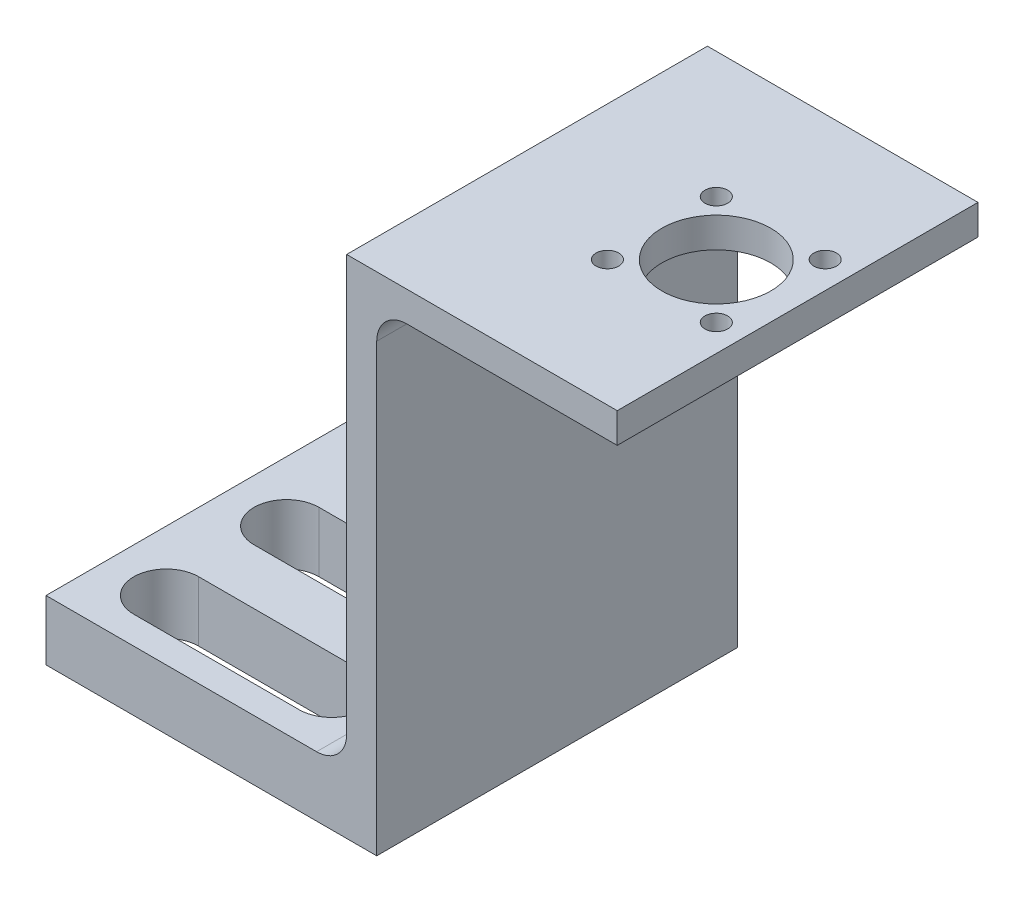
ISO-10303-21;
HEADER;
FILE_DESCRIPTION(('STEP AP214'),'2;1');
FILE_NAME('part.step','',(''),(''),'','','');
FILE_SCHEMA(('AUTOMOTIVE_DESIGN { 1 0 10303 214 1 1 1 1 }'));
ENDSEC;
DATA;
#1=APPLICATION_CONTEXT('core data for automotive mechanical design processes');
#2=APPLICATION_PROTOCOL_DEFINITION('international standard','automotive_design',2000,#1);
#3=PRODUCT_CONTEXT('',#1,'mechanical');
#4=PRODUCT('Part','Part','',(#3));
#5=PRODUCT_RELATED_PRODUCT_CATEGORY('part','',(#4));
#6=PRODUCT_DEFINITION_FORMATION('','',#4);
#7=PRODUCT_DEFINITION_CONTEXT('part definition',#1,'design');
#8=PRODUCT_DEFINITION('design','',#6,#7);
#9=PRODUCT_DEFINITION_SHAPE('','',#8);
#10=(LENGTH_UNIT() NAMED_UNIT(*) SI_UNIT(.MILLI.,.METRE.));
#11=(NAMED_UNIT(*) PLANE_ANGLE_UNIT() SI_UNIT($,.RADIAN.));
#12=(NAMED_UNIT(*) SI_UNIT($,.STERADIAN.) SOLID_ANGLE_UNIT());
#13=UNCERTAINTY_MEASURE_WITH_UNIT(LENGTH_MEASURE(1.E-05),#10,'distance_accuracy_value','');
#14=(GEOMETRIC_REPRESENTATION_CONTEXT(3) GLOBAL_UNCERTAINTY_ASSIGNED_CONTEXT((#13)) GLOBAL_UNIT_ASSIGNED_CONTEXT((#10,
#11,#12)) REPRESENTATION_CONTEXT('',''));
#15=CARTESIAN_POINT('',(0.,0.,0.));
#16=DIRECTION('',(0.,0.,1.));
#17=DIRECTION('',(1.,0.,0.));
#18=AXIS2_PLACEMENT_3D('',#15,#16,#17);
#19=CARTESIAN_POINT('',(-34.925,6.35,19.05));
#20=DIRECTION('',(1.,0.,0.));
#21=DIRECTION('',(0.,1.,0.));
#22=AXIS2_PLACEMENT_3D('',#19,#20,#21);
#23=PLANE('',#22);
#24=DIRECTION('',(0.,-1.,0.));
#25=VECTOR('',#24,1.);
#26=CARTESIAN_POINT('',(-34.925,6.35,-19.05));
#27=LINE('',#26,#25);
#28=CARTESIAN_POINT('',(-34.925,6.35,-19.05));
#29=VERTEX_POINT('',#28);
#30=CARTESIAN_POINT('',(-34.925,0.,-19.05));
#31=VERTEX_POINT('',#30);
#32=EDGE_CURVE('E308',#29,#31,#27,.T.);
#33=ORIENTED_EDGE('',*,*,#32,.T.);
#34=DIRECTION('',(0.,0.,-1.));
#35=VECTOR('',#34,1.);
#36=CARTESIAN_POINT('',(-34.925,0.,19.05));
#37=LINE('',#36,#35);
#38=CARTESIAN_POINT('',(-34.925,0.,19.05));
#39=VERTEX_POINT('',#38);
#40=EDGE_CURVE('E363',#39,#31,#37,.T.);
#41=ORIENTED_EDGE('',*,*,#40,.F.);
#42=DIRECTION('',(0.,-1.,0.));
#43=VECTOR('',#42,1.);
#44=CARTESIAN_POINT('',(-34.925,6.35,19.05));
#45=LINE('',#44,#43);
#46=CARTESIAN_POINT('',(-34.925,6.35,19.05));
#47=VERTEX_POINT('',#46);
#48=EDGE_CURVE('E311',#47,#39,#45,.T.);
#49=ORIENTED_EDGE('',*,*,#48,.F.);
#50=DIRECTION('',(0.,0.,-1.));
#51=VECTOR('',#50,1.);
#52=CARTESIAN_POINT('',(-34.925,6.35,19.05));
#53=LINE('',#52,#51);
#54=EDGE_CURVE('E331',#47,#29,#53,.T.);
#55=ORIENTED_EDGE('',*,*,#54,.T.);
#56=EDGE_LOOP('',(#33,#41,#49,#55));
#57=FACE_BOUND('',#56,.T.);
#58=ADVANCED_FACE('F33',(#57),#23,.F.);
#59=CARTESIAN_POINT('',(-34.925,0.,19.05));
#60=DIRECTION('',(0.,1.,0.));
#61=DIRECTION('',(0.,0.,1.));
#62=AXIS2_PLACEMENT_3D('',#59,#60,#61);
#63=PLANE('',#62);
#64=DIRECTION('',(-1.,0.,0.));
#65=VECTOR('',#64,1.);
#66=CARTESIAN_POINT('',(-28.575,0.,-16.129));
#67=LINE('',#66,#65);
#68=CARTESIAN_POINT('',(-11.1125,0.,-16.129));
#69=VERTEX_POINT('',#68);
#70=CARTESIAN_POINT('',(-28.575,0.,-16.129));
#71=VERTEX_POINT('',#70);
#72=EDGE_CURVE('E209',#69,#71,#67,.T.);
#73=ORIENTED_EDGE('',*,*,#72,.T.);
#74=CARTESIAN_POINT('',(-28.575,0.,-12.7));
#75=DIRECTION('',(0.,1.,0.));
#76=DIRECTION('',(-1.,0.,0.));
#77=AXIS2_PLACEMENT_3D('',#74,#75,#76);
#78=CIRCLE('',#77,3.429);
#79=CARTESIAN_POINT('',(-28.575,0.,-9.271));
#80=VERTEX_POINT('',#79);
#81=EDGE_CURVE('E213',#71,#80,#78,.T.);
#82=ORIENTED_EDGE('',*,*,#81,.T.);
#83=DIRECTION('',(1.,0.,0.));
#84=VECTOR('',#83,1.);
#85=CARTESIAN_POINT('',(-28.575,0.,-9.271));
#86=LINE('',#85,#84);
#87=CARTESIAN_POINT('',(-11.1125,0.,-9.271));
#88=VERTEX_POINT('',#87);
#89=EDGE_CURVE('E190',#80,#88,#86,.T.);
#90=ORIENTED_EDGE('',*,*,#89,.T.);
#91=CARTESIAN_POINT('',(-11.1125,0.,-12.7));
#92=DIRECTION('',(0.,1.,0.));
#93=DIRECTION('',(-1.,0.,0.));
#94=AXIS2_PLACEMENT_3D('',#91,#92,#93);
#95=CIRCLE('',#94,3.429);
#96=EDGE_CURVE('E48',#88,#69,#95,.T.);
#97=ORIENTED_EDGE('',*,*,#96,.T.);
#98=EDGE_LOOP('',(#73,#82,#90,#97));
#99=FACE_BOUND('',#98,.T.);
#100=DIRECTION('',(-1.,0.,0.));
#101=VECTOR('',#100,1.);
#102=CARTESIAN_POINT('',(-28.575,0.,9.271));
#103=LINE('',#102,#101);
#104=CARTESIAN_POINT('',(-11.1125,0.,9.271));
#105=VERTEX_POINT('',#104);
#106=CARTESIAN_POINT('',(-28.575,0.,9.271));
#107=VERTEX_POINT('',#106);
#108=EDGE_CURVE('E240',#105,#107,#103,.T.);
#109=ORIENTED_EDGE('',*,*,#108,.T.);
#110=CARTESIAN_POINT('',(-28.575,0.,12.7));
#111=DIRECTION('',(0.,1.,0.));
#112=DIRECTION('',(-1.,0.,0.));
#113=AXIS2_PLACEMENT_3D('',#110,#111,#112);
#114=CIRCLE('',#113,3.429);
#115=CARTESIAN_POINT('',(-28.575,0.,16.129));
#116=VERTEX_POINT('',#115);
#117=EDGE_CURVE('E245',#107,#116,#114,.T.);
#118=ORIENTED_EDGE('',*,*,#117,.T.);
#119=DIRECTION('',(1.,0.,0.));
#120=VECTOR('',#119,1.);
#121=CARTESIAN_POINT('',(-28.575,0.,16.129));
#122=LINE('',#121,#120);
#123=CARTESIAN_POINT('',(-11.1125,0.,16.129));
#124=VERTEX_POINT('',#123);
#125=EDGE_CURVE('E218',#116,#124,#122,.T.);
#126=ORIENTED_EDGE('',*,*,#125,.T.);
#127=CARTESIAN_POINT('',(-11.1125,0.,12.7));
#128=DIRECTION('',(0.,1.,0.));
#129=DIRECTION('',(-1.,0.,0.));
#130=AXIS2_PLACEMENT_3D('',#127,#128,#129);
#131=CIRCLE('',#130,3.429);
#132=EDGE_CURVE('E232',#124,#105,#131,.T.);
#133=ORIENTED_EDGE('',*,*,#132,.T.);
#134=EDGE_LOOP('',(#109,#118,#126,#133));
#135=FACE_BOUND('',#134,.T.);
#136=DIRECTION('',(-1.,0.,0.));
#137=VECTOR('',#136,1.);
#138=CARTESIAN_POINT('',(-28.575,0.,-3.429));
#139=LINE('',#138,#137);
#140=CARTESIAN_POINT('',(-11.1125,0.,-3.429));
#141=VERTEX_POINT('',#140);
#142=CARTESIAN_POINT('',(-28.575,0.,-3.429));
#143=VERTEX_POINT('',#142);
#144=EDGE_CURVE('E259',#141,#143,#139,.T.);
#145=ORIENTED_EDGE('',*,*,#144,.T.);
#146=CARTESIAN_POINT('',(-28.575,0.,0.));
#147=DIRECTION('',(0.,1.,0.));
#148=DIRECTION('',(-1.,0.,0.));
#149=AXIS2_PLACEMENT_3D('',#146,#147,#148);
#150=CIRCLE('',#149,3.429);
#151=CARTESIAN_POINT('',(-28.575,0.,3.429));
#152=VERTEX_POINT('',#151);
#153=EDGE_CURVE('E249',#143,#152,#150,.T.);
#154=ORIENTED_EDGE('',*,*,#153,.T.);
#155=DIRECTION('',(1.,0.,0.));
#156=VECTOR('',#155,1.);
#157=CARTESIAN_POINT('',(-28.575,0.,3.429));
#158=LINE('',#157,#156);
#159=CARTESIAN_POINT('',(-11.1125,0.,3.429));
#160=VERTEX_POINT('',#159);
#161=EDGE_CURVE('E252',#152,#160,#158,.T.);
#162=ORIENTED_EDGE('',*,*,#161,.T.);
#163=CARTESIAN_POINT('',(-11.1125,0.,0.));
#164=DIRECTION('',(0.,1.,0.));
#165=DIRECTION('',(-1.,0.,0.));
#166=AXIS2_PLACEMENT_3D('',#163,#164,#165);
#167=CIRCLE('',#166,3.429);
#168=EDGE_CURVE('E256',#160,#141,#167,.T.);
#169=ORIENTED_EDGE('',*,*,#168,.T.);
#170=EDGE_LOOP('',(#145,#154,#162,#169));
#171=FACE_BOUND('',#170,.T.);
#172=DIRECTION('',(1.,0.,0.));
#173=VECTOR('',#172,1.);
#174=CARTESIAN_POINT('',(-34.925,0.,-19.05));
#175=LINE('',#174,#173);
#176=CARTESIAN_POINT('',(0.,0.,-19.05));
#177=VERTEX_POINT('',#176);
#178=EDGE_CURVE('E334',#31,#177,#175,.T.);
#179=ORIENTED_EDGE('',*,*,#178,.T.);
#180=DIRECTION('',(0.,0.,-1.));
#181=VECTOR('',#180,1.);
#182=CARTESIAN_POINT('',(0.,0.,19.05));
#183=LINE('',#182,#181);
#184=CARTESIAN_POINT('',(0.,0.,19.05));
#185=VERTEX_POINT('',#184);
#186=EDGE_CURVE('E360',#185,#177,#183,.T.);
#187=ORIENTED_EDGE('',*,*,#186,.F.);
#188=DIRECTION('',(1.,0.,0.));
#189=VECTOR('',#188,1.);
#190=CARTESIAN_POINT('',(-34.925,0.,19.05));
#191=LINE('',#190,#189);
#192=EDGE_CURVE('E314',#39,#185,#191,.T.);
#193=ORIENTED_EDGE('',*,*,#192,.F.);
#194=ORIENTED_EDGE('',*,*,#40,.T.);
#195=EDGE_LOOP('',(#179,#187,#193,#194));
#196=FACE_BOUND('',#195,.T.);
#197=ADVANCED_FACE('F405',(#99,#135,#171,#196),#63,.F.);
#198=CARTESIAN_POINT('',(0.,0.,19.05));
#199=DIRECTION('',(-1.,0.,0.));
#200=DIRECTION('',(0.,0.,1.));
#201=AXIS2_PLACEMENT_3D('',#198,#199,#200);
#202=PLANE('',#201);
#203=DIRECTION('',(0.,1.,0.));
#204=VECTOR('',#203,1.);
#205=CARTESIAN_POINT('',(0.,0.,-19.05));
#206=LINE('',#205,#204);
#207=CARTESIAN_POINT('',(0.,47.0662,-19.05));
#208=VERTEX_POINT('',#207);
#209=EDGE_CURVE('E336',#177,#208,#206,.T.);
#210=ORIENTED_EDGE('',*,*,#209,.T.);
#211=DIRECTION('',(0.,0.,-1.));
#212=VECTOR('',#211,1.);
#213=CARTESIAN_POINT('',(0.,47.0662,19.05));
#214=LINE('',#213,#212);
#215=CARTESIAN_POINT('',(0.,47.0662,19.05));
#216=VERTEX_POINT('',#215);
#217=EDGE_CURVE('E369',#208,#216,#214,.F.);
#218=ORIENTED_EDGE('',*,*,#217,.T.);
#219=DIRECTION('',(0.,1.,0.));
#220=VECTOR('',#219,1.);
#221=CARTESIAN_POINT('',(0.,0.,19.05));
#222=LINE('',#221,#220);
#223=EDGE_CURVE('E317',#185,#216,#222,.T.);
#224=ORIENTED_EDGE('',*,*,#223,.F.);
#225=ORIENTED_EDGE('',*,*,#186,.T.);
#226=EDGE_LOOP('',(#210,#218,#224,#225));
#227=FACE_BOUND('',#226,.T.);
#228=ADVANCED_FACE('F408',(#227),#202,.F.);
#229=CARTESIAN_POINT('',(0.,50.2412,19.05));
#230=DIRECTION('',(0.,1.,0.));
#231=DIRECTION('',(0.,0.,1.));
#232=AXIS2_PLACEMENT_3D('',#229,#230,#231);
#233=PLANE('',#232);
#234=CARTESIAN_POINT('',(22.5625,50.2412,5.75));
#235=DIRECTION('',(0.,-1.,0.));
#236=DIRECTION('',(0.,0.,-1.));
#237=AXIS2_PLACEMENT_3D('',#234,#235,#236);
#238=CIRCLE('',#237,1.2);
#239=CARTESIAN_POINT('',(22.5625,50.2412,4.55));
#240=VERTEX_POINT('',#239);
#241=EDGE_CURVE('E274',#240,#240,#238,.T.);
#242=ORIENTED_EDGE('',*,*,#241,.F.);
#243=EDGE_LOOP('',(#242));
#244=FACE_BOUND('',#243,.T.);
#245=CARTESIAN_POINT('',(22.5625,50.2412,-5.75));
#246=DIRECTION('',(0.,-1.,0.));
#247=DIRECTION('',(0.,0.,-1.));
#248=AXIS2_PLACEMENT_3D('',#245,#246,#247);
#249=CIRCLE('',#248,1.2);
#250=CARTESIAN_POINT('',(22.5625,50.2412,-6.95));
#251=VERTEX_POINT('',#250);
#252=EDGE_CURVE('E286',#251,#251,#249,.T.);
#253=ORIENTED_EDGE('',*,*,#252,.F.);
#254=EDGE_LOOP('',(#253));
#255=FACE_BOUND('',#254,.T.);
#256=CARTESIAN_POINT('',(11.0625,50.2412,-5.75));
#257=DIRECTION('',(0.,-1.,0.));
#258=DIRECTION('',(0.,0.,-1.));
#259=AXIS2_PLACEMENT_3D('',#256,#257,#258);
#260=CIRCLE('',#259,1.2);
#261=CARTESIAN_POINT('',(11.0625,50.2412,-6.95));
#262=VERTEX_POINT('',#261);
#263=EDGE_CURVE('E292',#262,#262,#260,.T.);
#264=ORIENTED_EDGE('',*,*,#263,.F.);
#265=EDGE_LOOP('',(#264));
#266=FACE_BOUND('',#265,.T.);
#267=CARTESIAN_POINT('',(11.0625,50.2412,5.75));
#268=DIRECTION('',(0.,-1.,0.));
#269=DIRECTION('',(0.,0.,-1.));
#270=AXIS2_PLACEMENT_3D('',#267,#268,#269);
#271=CIRCLE('',#270,1.2);
#272=CARTESIAN_POINT('',(11.0625,50.2412,4.55));
#273=VERTEX_POINT('',#272);
#274=EDGE_CURVE('E298',#273,#273,#271,.T.);
#275=ORIENTED_EDGE('',*,*,#274,.F.);
#276=EDGE_LOOP('',(#275));
#277=FACE_BOUND('',#276,.T.);
#278=CARTESIAN_POINT('',(16.8125,50.2412,0.));
#279=DIRECTION('',(0.,-1.,0.));
#280=DIRECTION('',(0.,0.,-1.));
#281=AXIS2_PLACEMENT_3D('',#278,#279,#280);
#282=CIRCLE('',#281,5.75);
#283=CARTESIAN_POINT('',(16.8125,50.2412,-5.75));
#284=VERTEX_POINT('',#283);
#285=EDGE_CURVE('E304',#284,#284,#282,.T.);
#286=ORIENTED_EDGE('',*,*,#285,.F.);
#287=EDGE_LOOP('',(#286));
#288=FACE_BOUND('',#287,.T.);
#289=DIRECTION('',(1.,0.,0.));
#290=VECTOR('',#289,1.);
#291=CARTESIAN_POINT('',(0.,50.2412,19.05));
#292=LINE('',#291,#290);
#293=CARTESIAN_POINT('',(3.175,50.2412,19.05));
#294=VERTEX_POINT('',#293);
#295=CARTESIAN_POINT('',(25.4,50.2412,19.05));
#296=VERTEX_POINT('',#295);
#297=EDGE_CURVE('E320',#294,#296,#292,.T.);
#298=ORIENTED_EDGE('',*,*,#297,.F.);
#299=DIRECTION('',(0.,0.,-1.));
#300=VECTOR('',#299,1.);
#301=CARTESIAN_POINT('',(3.175,50.2412,-19.05));
#302=LINE('',#301,#300);
#303=CARTESIAN_POINT('',(3.175,50.2412,-19.05));
#304=VERTEX_POINT('',#303);
#305=EDGE_CURVE('E366',#294,#304,#302,.T.);
#306=ORIENTED_EDGE('',*,*,#305,.T.);
#307=DIRECTION('',(1.,0.,0.));
#308=VECTOR('',#307,1.);
#309=CARTESIAN_POINT('',(0.,50.2412,-19.05));
#310=LINE('',#309,#308);
#311=CARTESIAN_POINT('',(25.4,50.2412,-19.05));
#312=VERTEX_POINT('',#311);
#313=EDGE_CURVE('E339',#304,#312,#310,.T.);
#314=ORIENTED_EDGE('',*,*,#313,.T.);
#315=DIRECTION('',(0.,0.,-1.));
#316=VECTOR('',#315,1.);
#317=CARTESIAN_POINT('',(25.4,50.2412,19.05));
#318=LINE('',#317,#316);
#319=EDGE_CURVE('E357',#296,#312,#318,.T.);
#320=ORIENTED_EDGE('',*,*,#319,.F.);
#321=EDGE_LOOP('',(#298,#306,#314,#320));
#322=FACE_BOUND('',#321,.T.);
#323=ADVANCED_FACE('F416',(#244,#255,#266,#277,#288,#322),#233,.F.);
#324=CARTESIAN_POINT('',(25.4,50.2412,19.05));
#325=DIRECTION('',(-1.,0.,0.));
#326=DIRECTION('',(0.,0.,1.));
#327=AXIS2_PLACEMENT_3D('',#324,#325,#326);
#328=PLANE('',#327);
#329=DIRECTION('',(0.,1.,0.));
#330=VECTOR('',#329,1.);
#331=CARTESIAN_POINT('',(25.4,50.2412,-19.05));
#332=LINE('',#331,#330);
#333=CARTESIAN_POINT('',(25.4,53.4162,-19.05));
#334=VERTEX_POINT('',#333);
#335=EDGE_CURVE('E341',#312,#334,#332,.T.);
#336=ORIENTED_EDGE('',*,*,#335,.T.);
#337=DIRECTION('',(0.,0.,-1.));
#338=VECTOR('',#337,1.);
#339=CARTESIAN_POINT('',(25.4,53.4162,19.05));
#340=LINE('',#339,#338);
#341=CARTESIAN_POINT('',(25.4,53.4162,19.05));
#342=VERTEX_POINT('',#341);
#343=EDGE_CURVE('E354',#342,#334,#340,.T.);
#344=ORIENTED_EDGE('',*,*,#343,.F.);
#345=DIRECTION('',(0.,1.,0.));
#346=VECTOR('',#345,1.);
#347=CARTESIAN_POINT('',(25.4,50.2412,19.05));
#348=LINE('',#347,#346);
#349=EDGE_CURVE('E322',#296,#342,#348,.T.);
#350=ORIENTED_EDGE('',*,*,#349,.F.);
#351=ORIENTED_EDGE('',*,*,#319,.T.);
#352=EDGE_LOOP('',(#336,#344,#350,#351));
#353=FACE_BOUND('',#352,.T.);
#354=ADVANCED_FACE('F422',(#353),#328,.F.);
#355=CARTESIAN_POINT('',(25.4,53.4162,19.05));
#356=DIRECTION('',(0.,-1.,0.));
#357=DIRECTION('',(1.,0.,0.));
#358=AXIS2_PLACEMENT_3D('',#355,#356,#357);
#359=PLANE('',#358);
#360=CARTESIAN_POINT('',(22.5625,53.4162,5.75));
#361=DIRECTION('',(0.,-1.,0.));
#362=DIRECTION('',(0.,0.,-1.));
#363=AXIS2_PLACEMENT_3D('',#360,#361,#362);
#364=CIRCLE('',#363,1.19999999999999);
#365=CARTESIAN_POINT('',(22.5625,53.4162,4.55000000000001));
#366=VERTEX_POINT('',#365);
#367=EDGE_CURVE('E283',#366,#366,#364,.T.);
#368=ORIENTED_EDGE('',*,*,#367,.T.);
#369=EDGE_LOOP('',(#368));
#370=FACE_BOUND('',#369,.T.);
#371=CARTESIAN_POINT('',(22.5625,53.4162,-5.75));
#372=DIRECTION('',(0.,-1.,0.));
#373=DIRECTION('',(0.,0.,-1.));
#374=AXIS2_PLACEMENT_3D('',#371,#372,#373);
#375=CIRCLE('',#374,1.19999999999999);
#376=CARTESIAN_POINT('',(22.5625,53.4162,-6.94999999999999));
#377=VERTEX_POINT('',#376);
#378=EDGE_CURVE('E289',#377,#377,#375,.T.);
#379=ORIENTED_EDGE('',*,*,#378,.T.);
#380=EDGE_LOOP('',(#379));
#381=FACE_BOUND('',#380,.T.);
#382=CARTESIAN_POINT('',(11.0625,53.4162,-5.75));
#383=DIRECTION('',(0.,-1.,0.));
#384=DIRECTION('',(0.,0.,-1.));
#385=AXIS2_PLACEMENT_3D('',#382,#383,#384);
#386=CIRCLE('',#385,1.19999999999999);
#387=CARTESIAN_POINT('',(11.0625,53.4162,-6.95));
#388=VERTEX_POINT('',#387);
#389=EDGE_CURVE('E295',#388,#388,#386,.T.);
#390=ORIENTED_EDGE('',*,*,#389,.T.);
#391=EDGE_LOOP('',(#390));
#392=FACE_BOUND('',#391,.T.);
#393=CARTESIAN_POINT('',(11.0625,53.4162,5.75));
#394=DIRECTION('',(0.,-1.,0.));
#395=DIRECTION('',(0.,0.,-1.));
#396=AXIS2_PLACEMENT_3D('',#393,#394,#395);
#397=CIRCLE('',#396,1.19999999999999);
#398=CARTESIAN_POINT('',(11.0625,53.4162,4.55));
#399=VERTEX_POINT('',#398);
#400=EDGE_CURVE('E301',#399,#399,#397,.T.);
#401=ORIENTED_EDGE('',*,*,#400,.T.);
#402=EDGE_LOOP('',(#401));
#403=FACE_BOUND('',#402,.T.);
#404=CARTESIAN_POINT('',(16.8125,53.4162,0.));
#405=DIRECTION('',(0.,-1.,0.));
#406=DIRECTION('',(0.,0.,-1.));
#407=AXIS2_PLACEMENT_3D('',#404,#405,#406);
#408=CIRCLE('',#407,5.75);
#409=CARTESIAN_POINT('',(16.8125,53.4162,-5.75));
#410=VERTEX_POINT('',#409);
#411=EDGE_CURVE('E305',#410,#410,#408,.T.);
#412=ORIENTED_EDGE('',*,*,#411,.T.);
#413=EDGE_LOOP('',(#412));
#414=FACE_BOUND('',#413,.T.);
#415=DIRECTION('',(-1.,0.,0.));
#416=VECTOR('',#415,1.);
#417=CARTESIAN_POINT('',(25.4,53.4162,-19.05));
#418=LINE('',#417,#416);
#419=CARTESIAN_POINT('',(-3.175,53.4162,-19.05));
#420=VERTEX_POINT('',#419);
#421=EDGE_CURVE('E343',#334,#420,#418,.T.);
#422=ORIENTED_EDGE('',*,*,#421,.T.);
#423=DIRECTION('',(0.,0.,-1.));
#424=VECTOR('',#423,1.);
#425=CARTESIAN_POINT('',(-3.175,53.4162,19.05));
#426=LINE('',#425,#424);
#427=CARTESIAN_POINT('',(-3.175,53.4162,19.05));
#428=VERTEX_POINT('',#427);
#429=EDGE_CURVE('E351',#428,#420,#426,.T.);
#430=ORIENTED_EDGE('',*,*,#429,.F.);
#431=DIRECTION('',(-1.,0.,0.));
#432=VECTOR('',#431,1.);
#433=CARTESIAN_POINT('',(25.4,53.4162,19.05));
#434=LINE('',#433,#432);
#435=EDGE_CURVE('E324',#342,#428,#434,.T.);
#436=ORIENTED_EDGE('',*,*,#435,.F.);
#437=ORIENTED_EDGE('',*,*,#343,.T.);
#438=EDGE_LOOP('',(#422,#430,#436,#437));
#439=FACE_BOUND('',#438,.T.);
#440=ADVANCED_FACE('F425',(#370,#381,#392,#403,#414,#439),#359,.F.);
#441=CARTESIAN_POINT('',(-3.175,53.4162,19.05));
#442=DIRECTION('',(1.,0.,0.));
#443=DIRECTION('',(0.,1.,0.));
#444=AXIS2_PLACEMENT_3D('',#441,#442,#443);
#445=PLANE('',#444);
#446=DIRECTION('',(0.,-1.,0.));
#447=VECTOR('',#446,1.);
#448=CARTESIAN_POINT('',(-3.175,53.4162,-19.05));
#449=LINE('',#448,#447);
#450=CARTESIAN_POINT('',(-3.17499999999999,9.52500000000001,-19.05));
#451=VERTEX_POINT('',#450);
#452=EDGE_CURVE('E345',#420,#451,#449,.T.);
#453=ORIENTED_EDGE('',*,*,#452,.T.);
#454=DIRECTION('',(0.,0.,-1.));
#455=VECTOR('',#454,1.);
#456=CARTESIAN_POINT('',(-3.17499999999999,9.525,19.05));
#457=LINE('',#456,#455);
#458=CARTESIAN_POINT('',(-3.17499999999999,9.52500000000001,19.05));
#459=VERTEX_POINT('',#458);
#460=EDGE_CURVE('E374',#451,#459,#457,.F.);
#461=ORIENTED_EDGE('',*,*,#460,.T.);
#462=DIRECTION('',(0.,-1.,0.));
#463=VECTOR('',#462,1.);
#464=CARTESIAN_POINT('',(-3.175,53.4162,19.05));
#465=LINE('',#464,#463);
#466=EDGE_CURVE('E326',#428,#459,#465,.T.);
#467=ORIENTED_EDGE('',*,*,#466,.F.);
#468=ORIENTED_EDGE('',*,*,#429,.T.);
#469=EDGE_LOOP('',(#453,#461,#467,#468));
#470=FACE_BOUND('',#469,.T.);
#471=ADVANCED_FACE('F389',(#470),#445,.F.);
#472=CARTESIAN_POINT('',(-3.17499999999999,6.35,19.05));
#473=DIRECTION('',(0.,-1.,0.));
#474=DIRECTION('',(1.,0.,0.));
#475=AXIS2_PLACEMENT_3D('',#472,#473,#474);
#476=PLANE('',#475);
#477=DIRECTION('',(1.,0.,0.));
#478=VECTOR('',#477,1.);
#479=CARTESIAN_POINT('',(-28.575,6.35,-9.271));
#480=LINE('',#479,#478);
#481=CARTESIAN_POINT('',(-28.575,6.35,-9.271));
#482=VERTEX_POINT('',#481);
#483=CARTESIAN_POINT('',(-11.1125,6.35,-9.271));
#484=VERTEX_POINT('',#483);
#485=EDGE_CURVE('E183',#482,#484,#480,.T.);
#486=ORIENTED_EDGE('',*,*,#485,.F.);
#487=CARTESIAN_POINT('',(-28.575,6.35,-12.7));
#488=DIRECTION('',(0.,1.,0.));
#489=DIRECTION('',(-1.,0.,0.));
#490=AXIS2_PLACEMENT_3D('',#487,#488,#489);
#491=CIRCLE('',#490,3.429);
#492=CARTESIAN_POINT('',(-28.575,6.35,-16.129));
#493=VERTEX_POINT('',#492);
#494=EDGE_CURVE('E56',#493,#482,#491,.T.);
#495=ORIENTED_EDGE('',*,*,#494,.F.);
#496=DIRECTION('',(-1.,0.,0.));
#497=VECTOR('',#496,1.);
#498=CARTESIAN_POINT('',(-28.575,6.35,-16.129));
#499=LINE('',#498,#497);
#500=CARTESIAN_POINT('',(-11.1125,6.35,-16.129));
#501=VERTEX_POINT('',#500);
#502=EDGE_CURVE('E199',#501,#493,#499,.T.);
#503=ORIENTED_EDGE('',*,*,#502,.F.);
#504=CARTESIAN_POINT('',(-11.1125,6.35,-12.7));
#505=DIRECTION('',(0.,1.,0.));
#506=DIRECTION('',(-1.,0.,0.));
#507=AXIS2_PLACEMENT_3D('',#504,#505,#506);
#508=CIRCLE('',#507,3.429);
#509=EDGE_CURVE('E193',#484,#501,#508,.T.);
#510=ORIENTED_EDGE('',*,*,#509,.F.);
#511=EDGE_LOOP('',(#486,#495,#503,#510));
#512=FACE_BOUND('',#511,.T.);
#513=DIRECTION('',(1.,0.,0.));
#514=VECTOR('',#513,1.);
#515=CARTESIAN_POINT('',(-28.575,6.35,16.129));
#516=LINE('',#515,#514);
#517=CARTESIAN_POINT('',(-28.575,6.35,16.129));
#518=VERTEX_POINT('',#517);
#519=CARTESIAN_POINT('',(-11.1125,6.35,16.129));
#520=VERTEX_POINT('',#519);
#521=EDGE_CURVE('E216',#518,#520,#516,.T.);
#522=ORIENTED_EDGE('',*,*,#521,.F.);
#523=CARTESIAN_POINT('',(-28.575,6.35,12.7));
#524=DIRECTION('',(0.,1.,0.));
#525=DIRECTION('',(-1.,0.,0.));
#526=AXIS2_PLACEMENT_3D('',#523,#524,#525);
#527=CIRCLE('',#526,3.429);
#528=CARTESIAN_POINT('',(-28.575,6.35,9.271));
#529=VERTEX_POINT('',#528);
#530=EDGE_CURVE('E243',#529,#518,#527,.T.);
#531=ORIENTED_EDGE('',*,*,#530,.F.);
#532=DIRECTION('',(-1.,0.,0.));
#533=VECTOR('',#532,1.);
#534=CARTESIAN_POINT('',(-28.575,6.35,9.271));
#535=LINE('',#534,#533);
#536=CARTESIAN_POINT('',(-11.1125,6.35,9.271));
#537=VERTEX_POINT('',#536);
#538=EDGE_CURVE('E235',#537,#529,#535,.T.);
#539=ORIENTED_EDGE('',*,*,#538,.F.);
#540=CARTESIAN_POINT('',(-11.1125,6.35,12.7));
#541=DIRECTION('',(0.,1.,0.));
#542=DIRECTION('',(-1.,0.,0.));
#543=AXIS2_PLACEMENT_3D('',#540,#541,#542);
#544=CIRCLE('',#543,3.429);
#545=EDGE_CURVE('E227',#520,#537,#544,.T.);
#546=ORIENTED_EDGE('',*,*,#545,.F.);
#547=EDGE_LOOP('',(#522,#531,#539,#546));
#548=FACE_BOUND('',#547,.T.);
#549=DIRECTION('',(1.,0.,0.));
#550=VECTOR('',#549,1.);
#551=CARTESIAN_POINT('',(-28.575,6.35,3.429));
#552=LINE('',#551,#550);
#553=CARTESIAN_POINT('',(-28.575,6.35,3.429));
#554=VERTEX_POINT('',#553);
#555=CARTESIAN_POINT('',(-11.1125,6.35,3.429));
#556=VERTEX_POINT('',#555);
#557=EDGE_CURVE('E264',#554,#556,#552,.T.);
#558=ORIENTED_EDGE('',*,*,#557,.F.);
#559=CARTESIAN_POINT('',(-28.575,6.35,0.));
#560=DIRECTION('',(0.,1.,0.));
#561=DIRECTION('',(-1.,0.,0.));
#562=AXIS2_PLACEMENT_3D('',#559,#560,#561);
#563=CIRCLE('',#562,3.429);
#564=CARTESIAN_POINT('',(-28.575,6.35,-3.429));
#565=VERTEX_POINT('',#564);
#566=EDGE_CURVE('E248',#565,#554,#563,.T.);
#567=ORIENTED_EDGE('',*,*,#566,.F.);
#568=DIRECTION('',(-1.,0.,0.));
#569=VECTOR('',#568,1.);
#570=CARTESIAN_POINT('',(-28.575,6.35,-3.429));
#571=LINE('',#570,#569);
#572=CARTESIAN_POINT('',(-11.1125,6.35,-3.429));
#573=VERTEX_POINT('',#572);
#574=EDGE_CURVE('E253',#573,#565,#571,.T.);
#575=ORIENTED_EDGE('',*,*,#574,.F.);
#576=CARTESIAN_POINT('',(-11.1125,6.35,0.));
#577=DIRECTION('',(0.,1.,0.));
#578=DIRECTION('',(-1.,0.,0.));
#579=AXIS2_PLACEMENT_3D('',#576,#577,#578);
#580=CIRCLE('',#579,3.429);
#581=EDGE_CURVE('E267',#556,#573,#580,.T.);
#582=ORIENTED_EDGE('',*,*,#581,.F.);
#583=EDGE_LOOP('',(#558,#567,#575,#582));
#584=FACE_BOUND('',#583,.T.);
#585=DIRECTION('',(-1.,0.,0.));
#586=VECTOR('',#585,1.);
#587=CARTESIAN_POINT('',(-3.17499999999999,6.35,19.05));
#588=LINE('',#587,#586);
#589=CARTESIAN_POINT('',(-6.34999999999999,6.35,19.05));
#590=VERTEX_POINT('',#589);
#591=EDGE_CURVE('E329',#590,#47,#588,.T.);
#592=ORIENTED_EDGE('',*,*,#591,.F.);
#593=DIRECTION('',(0.,0.,-1.));
#594=VECTOR('',#593,1.);
#595=CARTESIAN_POINT('',(-6.34999999999999,6.35,-19.05));
#596=LINE('',#595,#594);
#597=CARTESIAN_POINT('',(-6.34999999999999,6.35,-19.05));
#598=VERTEX_POINT('',#597);
#599=EDGE_CURVE('E371',#590,#598,#596,.T.);
#600=ORIENTED_EDGE('',*,*,#599,.T.);
#601=DIRECTION('',(-1.,0.,0.));
#602=VECTOR('',#601,1.);
#603=CARTESIAN_POINT('',(-3.17499999999999,6.35,-19.05));
#604=LINE('',#603,#602);
#605=EDGE_CURVE('E315',#598,#29,#604,.T.);
#606=ORIENTED_EDGE('',*,*,#605,.T.);
#607=ORIENTED_EDGE('',*,*,#54,.F.);
#608=EDGE_LOOP('',(#592,#600,#606,#607));
#609=FACE_BOUND('',#608,.T.);
#610=ADVANCED_FACE('F197',(#512,#548,#584,#609),#476,.F.);
#611=CARTESIAN_POINT('',(0.,0.,19.05));
#612=DIRECTION('',(0.,0.,1.));
#613=DIRECTION('',(1.,0.,0.));
#614=AXIS2_PLACEMENT_3D('',#611,#612,#613);
#615=PLANE('',#614);
#616=ORIENTED_EDGE('',*,*,#48,.T.);
#617=ORIENTED_EDGE('',*,*,#192,.T.);
#618=ORIENTED_EDGE('',*,*,#223,.T.);
#619=CARTESIAN_POINT('',(3.175,47.0662,19.05));
#620=DIRECTION('',(0.,0.,1.));
#621=DIRECTION('',(1.,0.,0.));
#622=AXIS2_PLACEMENT_3D('',#619,#620,#621);
#623=CIRCLE('',#622,3.175);
#624=EDGE_CURVE('E378',#216,#294,#623,.F.);
#625=ORIENTED_EDGE('',*,*,#624,.T.);
#626=ORIENTED_EDGE('',*,*,#297,.T.);
#627=ORIENTED_EDGE('',*,*,#349,.T.);
#628=ORIENTED_EDGE('',*,*,#435,.T.);
#629=ORIENTED_EDGE('',*,*,#466,.T.);
#630=CARTESIAN_POINT('',(-6.34999999999999,9.525,19.05));
#631=DIRECTION('',(0.,0.,1.));
#632=DIRECTION('',(1.,0.,0.));
#633=AXIS2_PLACEMENT_3D('',#630,#631,#632);
#634=CIRCLE('',#633,3.175);
#635=EDGE_CURVE('E11',#459,#590,#634,.F.);
#636=ORIENTED_EDGE('',*,*,#635,.T.);
#637=ORIENTED_EDGE('',*,*,#591,.T.);
#638=EDGE_LOOP('',(#616,#617,#618,#625,#626,#627,#628,#629,#636,#637));
#639=FACE_BOUND('',#638,.T.);
#640=ADVANCED_FACE('F395',(#639),#615,.T.);
#641=CARTESIAN_POINT('',(0.,0.,-19.05));
#642=DIRECTION('',(0.,0.,1.));
#643=DIRECTION('',(1.,0.,0.));
#644=AXIS2_PLACEMENT_3D('',#641,#642,#643);
#645=PLANE('',#644);
#646=ORIENTED_EDGE('',*,*,#32,.F.);
#647=ORIENTED_EDGE('',*,*,#605,.F.);
#648=CARTESIAN_POINT('',(-6.34999999999999,9.525,-19.05));
#649=DIRECTION('',(0.,0.,1.));
#650=DIRECTION('',(1.,0.,0.));
#651=AXIS2_PLACEMENT_3D('',#648,#649,#650);
#652=CIRCLE('',#651,3.175);
#653=EDGE_CURVE('E41',#598,#451,#652,.T.);
#654=ORIENTED_EDGE('',*,*,#653,.T.);
#655=ORIENTED_EDGE('',*,*,#452,.F.);
#656=ORIENTED_EDGE('',*,*,#421,.F.);
#657=ORIENTED_EDGE('',*,*,#335,.F.);
#658=ORIENTED_EDGE('',*,*,#313,.F.);
#659=CARTESIAN_POINT('',(3.175,47.0662,-19.05));
#660=DIRECTION('',(0.,0.,1.));
#661=DIRECTION('',(1.,0.,0.));
#662=AXIS2_PLACEMENT_3D('',#659,#660,#661);
#663=CIRCLE('',#662,3.175);
#664=EDGE_CURVE('E376',#304,#208,#663,.T.);
#665=ORIENTED_EDGE('',*,*,#664,.T.);
#666=ORIENTED_EDGE('',*,*,#209,.F.);
#667=ORIENTED_EDGE('',*,*,#178,.F.);
#668=EDGE_LOOP('',(#646,#647,#654,#655,#656,#657,#658,#665,#666,#667));
#669=FACE_BOUND('',#668,.T.);
#670=ADVANCED_FACE('F383',(#669),#645,.F.);
#671=CARTESIAN_POINT('',(3.175,47.0662,19.05));
#672=DIRECTION('',(0.,0.,1.));
#673=DIRECTION('',(1.,0.,0.));
#674=AXIS2_PLACEMENT_3D('',#671,#672,#673);
#675=CYLINDRICAL_SURFACE('',#674,3.175);
#676=ORIENTED_EDGE('',*,*,#624,.F.);
#677=ORIENTED_EDGE('',*,*,#217,.F.);
#678=ORIENTED_EDGE('',*,*,#664,.F.);
#679=ORIENTED_EDGE('',*,*,#305,.F.);
#680=EDGE_LOOP('',(#676,#677,#678,#679));
#681=FACE_BOUND('',#680,.T.);
#682=ADVANCED_FACE('F411',(#681),#675,.F.);
#683=CARTESIAN_POINT('',(-6.34999999999999,9.525,19.05));
#684=DIRECTION('',(0.,0.,1.));
#685=DIRECTION('',(1.,0.,0.));
#686=AXIS2_PLACEMENT_3D('',#683,#684,#685);
#687=CYLINDRICAL_SURFACE('',#686,3.175);
#688=ORIENTED_EDGE('',*,*,#635,.F.);
#689=ORIENTED_EDGE('',*,*,#460,.F.);
#690=ORIENTED_EDGE('',*,*,#653,.F.);
#691=ORIENTED_EDGE('',*,*,#599,.F.);
#692=EDGE_LOOP('',(#688,#689,#690,#691));
#693=FACE_BOUND('',#692,.T.);
#694=ADVANCED_FACE('F35',(#693),#687,.F.);
#695=CARTESIAN_POINT('',(16.8125,53.4162,0.));
#696=DIRECTION('',(0.,-1.,0.));
#697=DIRECTION('',(0.,0.,-1.));
#698=AXIS2_PLACEMENT_3D('',#695,#696,#697);
#699=CYLINDRICAL_SURFACE('',#698,5.75);
#700=ORIENTED_EDGE('',*,*,#411,.F.);
#701=EDGE_LOOP('',(#700));
#702=FACE_BOUND('',#701,.T.);
#703=ORIENTED_EDGE('',*,*,#285,.T.);
#704=EDGE_LOOP('',(#703));
#705=FACE_BOUND('',#704,.T.);
#706=ADVANCED_FACE('F449',(#702,#705),#699,.F.);
#707=CARTESIAN_POINT('',(11.0625,50.2412,5.75));
#708=DIRECTION('',(0.,-1.,0.));
#709=DIRECTION('',(0.,0.,-1.));
#710=AXIS2_PLACEMENT_3D('',#707,#708,#709);
#711=CYLINDRICAL_SURFACE('',#710,1.2);
#712=ORIENTED_EDGE('',*,*,#400,.F.);
#713=EDGE_LOOP('',(#712));
#714=FACE_BOUND('',#713,.T.);
#715=ORIENTED_EDGE('',*,*,#274,.T.);
#716=EDGE_LOOP('',(#715));
#717=FACE_BOUND('',#716,.T.);
#718=ADVANCED_FACE('F494',(#714,#717),#711,.F.);
#719=CARTESIAN_POINT('',(11.0625,50.2412,-5.75));
#720=DIRECTION('',(0.,-1.,0.));
#721=DIRECTION('',(0.,0.,-1.));
#722=AXIS2_PLACEMENT_3D('',#719,#720,#721);
#723=CYLINDRICAL_SURFACE('',#722,1.2);
#724=ORIENTED_EDGE('',*,*,#389,.F.);
#725=EDGE_LOOP('',(#724));
#726=FACE_BOUND('',#725,.T.);
#727=ORIENTED_EDGE('',*,*,#263,.T.);
#728=EDGE_LOOP('',(#727));
#729=FACE_BOUND('',#728,.T.);
#730=ADVANCED_FACE('F519',(#726,#729),#723,.F.);
#731=CARTESIAN_POINT('',(22.5625,50.2412,-5.75));
#732=DIRECTION('',(0.,-1.,0.));
#733=DIRECTION('',(0.,0.,-1.));
#734=AXIS2_PLACEMENT_3D('',#731,#732,#733);
#735=CYLINDRICAL_SURFACE('',#734,1.2);
#736=ORIENTED_EDGE('',*,*,#378,.F.);
#737=EDGE_LOOP('',(#736));
#738=FACE_BOUND('',#737,.T.);
#739=ORIENTED_EDGE('',*,*,#252,.T.);
#740=EDGE_LOOP('',(#739));
#741=FACE_BOUND('',#740,.T.);
#742=ADVANCED_FACE('F529',(#738,#741),#735,.F.);
#743=CARTESIAN_POINT('',(22.5625,50.2412,5.75));
#744=DIRECTION('',(0.,-1.,0.));
#745=DIRECTION('',(0.,0.,-1.));
#746=AXIS2_PLACEMENT_3D('',#743,#744,#745);
#747=CYLINDRICAL_SURFACE('',#746,1.2);
#748=ORIENTED_EDGE('',*,*,#367,.F.);
#749=EDGE_LOOP('',(#748));
#750=FACE_BOUND('',#749,.T.);
#751=ORIENTED_EDGE('',*,*,#241,.T.);
#752=EDGE_LOOP('',(#751));
#753=FACE_BOUND('',#752,.T.);
#754=ADVANCED_FACE('F539',(#750,#753),#747,.F.);
#755=CARTESIAN_POINT('',(-28.575,0.,0.));
#756=DIRECTION('',(0.,1.,0.));
#757=DIRECTION('',(-1.,0.,0.));
#758=AXIS2_PLACEMENT_3D('',#755,#756,#757);
#759=CYLINDRICAL_SURFACE('',#758,3.429);
#760=ORIENTED_EDGE('',*,*,#566,.T.);
#761=DIRECTION('',(0.,1.,0.));
#762=VECTOR('',#761,1.);
#763=CARTESIAN_POINT('',(-28.575,0.,3.429));
#764=LINE('',#763,#762);
#765=EDGE_CURVE('E262',#152,#554,#764,.T.);
#766=ORIENTED_EDGE('',*,*,#765,.F.);
#767=ORIENTED_EDGE('',*,*,#153,.F.);
#768=DIRECTION('',(0.,1.,0.));
#769=VECTOR('',#768,1.);
#770=CARTESIAN_POINT('',(-28.575,0.,-3.429));
#771=LINE('',#770,#769);
#772=EDGE_CURVE('E272',#143,#565,#771,.T.);
#773=ORIENTED_EDGE('',*,*,#772,.T.);
#774=EDGE_LOOP('',(#760,#766,#767,#773));
#775=FACE_BOUND('',#774,.T.);
#776=ADVANCED_FACE('F549',(#775),#759,.F.);
#777=CARTESIAN_POINT('',(-28.575,0.,-3.429));
#778=DIRECTION('',(0.,0.,-1.));
#779=DIRECTION('',(-1.,0.,0.));
#780=AXIS2_PLACEMENT_3D('',#777,#778,#779);
#781=PLANE('',#780);
#782=ORIENTED_EDGE('',*,*,#574,.T.);
#783=ORIENTED_EDGE('',*,*,#772,.F.);
#784=ORIENTED_EDGE('',*,*,#144,.F.);
#785=DIRECTION('',(0.,1.,0.));
#786=VECTOR('',#785,1.);
#787=CARTESIAN_POINT('',(-11.1125,0.,-3.429));
#788=LINE('',#787,#786);
#789=EDGE_CURVE('E275',#141,#573,#788,.T.);
#790=ORIENTED_EDGE('',*,*,#789,.T.);
#791=EDGE_LOOP('',(#782,#783,#784,#790));
#792=FACE_BOUND('',#791,.T.);
#793=ADVANCED_FACE('F559',(#792),#781,.F.);
#794=CARTESIAN_POINT('',(-11.1125,0.,0.));
#795=DIRECTION('',(0.,1.,0.));
#796=DIRECTION('',(-1.,0.,0.));
#797=AXIS2_PLACEMENT_3D('',#794,#795,#796);
#798=CYLINDRICAL_SURFACE('',#797,3.429);
#799=ORIENTED_EDGE('',*,*,#581,.T.);
#800=ORIENTED_EDGE('',*,*,#789,.F.);
#801=ORIENTED_EDGE('',*,*,#168,.F.);
#802=DIRECTION('',(0.,1.,0.));
#803=VECTOR('',#802,1.);
#804=CARTESIAN_POINT('',(-11.1125,0.,3.429));
#805=LINE('',#804,#803);
#806=EDGE_CURVE('E277',#160,#556,#805,.T.);
#807=ORIENTED_EDGE('',*,*,#806,.T.);
#808=EDGE_LOOP('',(#799,#800,#801,#807));
#809=FACE_BOUND('',#808,.T.);
#810=ADVANCED_FACE('F569',(#809),#798,.F.);
#811=CARTESIAN_POINT('',(-28.575,0.,3.429));
#812=DIRECTION('',(0.,0.,1.));
#813=DIRECTION('',(1.,0.,0.));
#814=AXIS2_PLACEMENT_3D('',#811,#812,#813);
#815=PLANE('',#814);
#816=ORIENTED_EDGE('',*,*,#557,.T.);
#817=ORIENTED_EDGE('',*,*,#806,.F.);
#818=ORIENTED_EDGE('',*,*,#161,.F.);
#819=ORIENTED_EDGE('',*,*,#765,.T.);
#820=EDGE_LOOP('',(#816,#817,#818,#819));
#821=FACE_BOUND('',#820,.T.);
#822=ADVANCED_FACE('F579',(#821),#815,.F.);
#823=CARTESIAN_POINT('',(-28.575,0.,12.7));
#824=DIRECTION('',(0.,1.,0.));
#825=DIRECTION('',(-1.,0.,0.));
#826=AXIS2_PLACEMENT_3D('',#823,#824,#825);
#827=CYLINDRICAL_SURFACE('',#826,3.429);
#828=ORIENTED_EDGE('',*,*,#530,.T.);
#829=DIRECTION('',(0.,1.,0.));
#830=VECTOR('',#829,1.);
#831=CARTESIAN_POINT('',(-28.575,0.,16.129));
#832=LINE('',#831,#830);
#833=EDGE_CURVE('E224',#116,#518,#832,.T.);
#834=ORIENTED_EDGE('',*,*,#833,.F.);
#835=ORIENTED_EDGE('',*,*,#117,.F.);
#836=DIRECTION('',(0.,1.,0.));
#837=VECTOR('',#836,1.);
#838=CARTESIAN_POINT('',(-28.575,0.,9.271));
#839=LINE('',#838,#837);
#840=EDGE_CURVE('E237',#107,#529,#839,.T.);
#841=ORIENTED_EDGE('',*,*,#840,.T.);
#842=EDGE_LOOP('',(#828,#834,#835,#841));
#843=FACE_BOUND('',#842,.T.);
#844=ADVANCED_FACE('F588',(#843),#827,.F.);
#845=CARTESIAN_POINT('',(-28.575,0.,9.271));
#846=DIRECTION('',(0.,0.,-1.));
#847=DIRECTION('',(-1.,0.,0.));
#848=AXIS2_PLACEMENT_3D('',#845,#846,#847);
#849=PLANE('',#848);
#850=ORIENTED_EDGE('',*,*,#538,.T.);
#851=ORIENTED_EDGE('',*,*,#840,.F.);
#852=ORIENTED_EDGE('',*,*,#108,.F.);
#853=DIRECTION('',(0.,1.,0.));
#854=VECTOR('',#853,1.);
#855=CARTESIAN_POINT('',(-11.1125,0.,9.271));
#856=LINE('',#855,#854);
#857=EDGE_CURVE('E229',#105,#537,#856,.T.);
#858=ORIENTED_EDGE('',*,*,#857,.T.);
#859=EDGE_LOOP('',(#850,#851,#852,#858));
#860=FACE_BOUND('',#859,.T.);
#861=ADVANCED_FACE('F616',(#860),#849,.F.);
#862=CARTESIAN_POINT('',(-11.1125,0.,12.7));
#863=DIRECTION('',(0.,1.,0.));
#864=DIRECTION('',(-1.,0.,0.));
#865=AXIS2_PLACEMENT_3D('',#862,#863,#864);
#866=CYLINDRICAL_SURFACE('',#865,3.429);
#867=ORIENTED_EDGE('',*,*,#545,.T.);
#868=ORIENTED_EDGE('',*,*,#857,.F.);
#869=ORIENTED_EDGE('',*,*,#132,.F.);
#870=DIRECTION('',(0.,1.,0.));
#871=VECTOR('',#870,1.);
#872=CARTESIAN_POINT('',(-11.1125,0.,16.129));
#873=LINE('',#872,#871);
#874=EDGE_CURVE('E221',#124,#520,#873,.T.);
#875=ORIENTED_EDGE('',*,*,#874,.T.);
#876=EDGE_LOOP('',(#867,#868,#869,#875));
#877=FACE_BOUND('',#876,.T.);
#878=ADVANCED_FACE('F623',(#877),#866,.F.);
#879=CARTESIAN_POINT('',(-28.575,0.,16.129));
#880=DIRECTION('',(0.,0.,1.));
#881=DIRECTION('',(1.,0.,0.));
#882=AXIS2_PLACEMENT_3D('',#879,#880,#881);
#883=PLANE('',#882);
#884=ORIENTED_EDGE('',*,*,#521,.T.);
#885=ORIENTED_EDGE('',*,*,#874,.F.);
#886=ORIENTED_EDGE('',*,*,#125,.F.);
#887=ORIENTED_EDGE('',*,*,#833,.T.);
#888=EDGE_LOOP('',(#884,#885,#886,#887));
#889=FACE_BOUND('',#888,.T.);
#890=ADVANCED_FACE('F631',(#889),#883,.F.);
#891=CARTESIAN_POINT('',(-28.575,0.,-12.7));
#892=DIRECTION('',(0.,1.,0.));
#893=DIRECTION('',(-1.,0.,0.));
#894=AXIS2_PLACEMENT_3D('',#891,#892,#893);
#895=CYLINDRICAL_SURFACE('',#894,3.429);
#896=ORIENTED_EDGE('',*,*,#494,.T.);
#897=DIRECTION('',(0.,1.,0.));
#898=VECTOR('',#897,1.);
#899=CARTESIAN_POINT('',(-28.575,0.,-9.271));
#900=LINE('',#899,#898);
#901=EDGE_CURVE('E187',#80,#482,#900,.T.);
#902=ORIENTED_EDGE('',*,*,#901,.F.);
#903=ORIENTED_EDGE('',*,*,#81,.F.);
#904=DIRECTION('',(0.,1.,0.));
#905=VECTOR('',#904,1.);
#906=CARTESIAN_POINT('',(-28.575,0.,-16.129));
#907=LINE('',#906,#905);
#908=EDGE_CURVE('E207',#71,#493,#907,.T.);
#909=ORIENTED_EDGE('',*,*,#908,.T.);
#910=EDGE_LOOP('',(#896,#902,#903,#909));
#911=FACE_BOUND('',#910,.T.);
#912=ADVANCED_FACE('F639',(#911),#895,.F.);
#913=CARTESIAN_POINT('',(-28.575,0.,-16.129));
#914=DIRECTION('',(0.,0.,-1.));
#915=DIRECTION('',(-1.,0.,0.));
#916=AXIS2_PLACEMENT_3D('',#913,#914,#915);
#917=PLANE('',#916);
#918=ORIENTED_EDGE('',*,*,#502,.T.);
#919=ORIENTED_EDGE('',*,*,#908,.F.);
#920=ORIENTED_EDGE('',*,*,#72,.F.);
#921=DIRECTION('',(0.,1.,0.));
#922=VECTOR('',#921,1.);
#923=CARTESIAN_POINT('',(-11.1125,0.,-16.129));
#924=LINE('',#923,#922);
#925=EDGE_CURVE('E200',#69,#501,#924,.T.);
#926=ORIENTED_EDGE('',*,*,#925,.T.);
#927=EDGE_LOOP('',(#918,#919,#920,#926));
#928=FACE_BOUND('',#927,.T.);
#929=ADVANCED_FACE('F647',(#928),#917,.F.);
#930=CARTESIAN_POINT('',(-11.1125,0.,-12.7));
#931=DIRECTION('',(0.,1.,0.));
#932=DIRECTION('',(-1.,0.,0.));
#933=AXIS2_PLACEMENT_3D('',#930,#931,#932);
#934=CYLINDRICAL_SURFACE('',#933,3.429);
#935=ORIENTED_EDGE('',*,*,#509,.T.);
#936=ORIENTED_EDGE('',*,*,#925,.F.);
#937=ORIENTED_EDGE('',*,*,#96,.F.);
#938=DIRECTION('',(0.,1.,0.));
#939=VECTOR('',#938,1.);
#940=CARTESIAN_POINT('',(-11.1125,0.,-9.271));
#941=LINE('',#940,#939);
#942=EDGE_CURVE('E185',#88,#484,#941,.T.);
#943=ORIENTED_EDGE('',*,*,#942,.T.);
#944=EDGE_LOOP('',(#935,#936,#937,#943));
#945=FACE_BOUND('',#944,.T.);
#946=ADVANCED_FACE('F192',(#945),#934,.F.);
#947=CARTESIAN_POINT('',(-28.575,0.,-9.271));
#948=DIRECTION('',(0.,0.,1.));
#949=DIRECTION('',(1.,0.,0.));
#950=AXIS2_PLACEMENT_3D('',#947,#948,#949);
#951=PLANE('',#950);
#952=ORIENTED_EDGE('',*,*,#485,.T.);
#953=ORIENTED_EDGE('',*,*,#942,.F.);
#954=ORIENTED_EDGE('',*,*,#89,.F.);
#955=ORIENTED_EDGE('',*,*,#901,.T.);
#956=EDGE_LOOP('',(#952,#953,#954,#955));
#957=FACE_BOUND('',#956,.T.);
#958=ADVANCED_FACE('F184',(#957),#951,.F.);
#959=CLOSED_SHELL('',(#58,#197,#228,#323,#354,#440,#471,#610,#640,#670,#682,#694,#706,#718,#730,
#742,#754,#776,#793,#810,#822,#844,#861,#878,#890,#912,#929,#946,#958));
#960=MANIFOLD_SOLID_BREP('B2',#959);
#961=ADVANCED_BREP_SHAPE_REPRESENTATION('',(#18,#960),#14);
#962=SHAPE_DEFINITION_REPRESENTATION(#9,#961);
ENDSEC;
END-ISO-10303-21;
